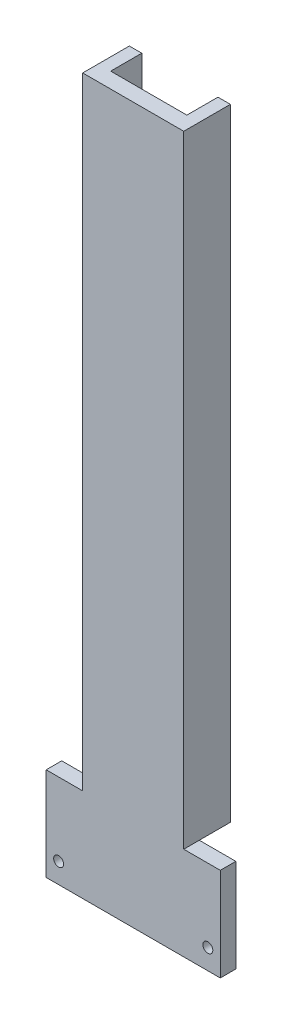
ISO-10303-21;
HEADER;
FILE_DESCRIPTION(('STEP AP214'),'2;1');
FILE_NAME('part.step','',(''),(''),'','','');
FILE_SCHEMA(('AUTOMOTIVE_DESIGN { 1 0 10303 214 1 1 1 1 }'));
ENDSEC;
DATA;
#1=APPLICATION_CONTEXT('core data for automotive mechanical design processes');
#2=APPLICATION_PROTOCOL_DEFINITION('international standard','automotive_design',2000,#1);
#3=PRODUCT_CONTEXT('',#1,'mechanical');
#4=PRODUCT('Part','Part','',(#3));
#5=PRODUCT_RELATED_PRODUCT_CATEGORY('part','',(#4));
#6=PRODUCT_DEFINITION_FORMATION('','',#4);
#7=PRODUCT_DEFINITION_CONTEXT('part definition',#1,'design');
#8=PRODUCT_DEFINITION('design','',#6,#7);
#9=PRODUCT_DEFINITION_SHAPE('','',#8);
#10=(LENGTH_UNIT() NAMED_UNIT(*) SI_UNIT(.MILLI.,.METRE.));
#11=(NAMED_UNIT(*) PLANE_ANGLE_UNIT() SI_UNIT($,.RADIAN.));
#12=(NAMED_UNIT(*) SI_UNIT($,.STERADIAN.) SOLID_ANGLE_UNIT());
#13=UNCERTAINTY_MEASURE_WITH_UNIT(LENGTH_MEASURE(1.E-05),#10,'distance_accuracy_value','');
#14=(GEOMETRIC_REPRESENTATION_CONTEXT(3) GLOBAL_UNCERTAINTY_ASSIGNED_CONTEXT((#13)) GLOBAL_UNIT_ASSIGNED_CONTEXT((#10,
#11,#12)) REPRESENTATION_CONTEXT('',''));
#15=CARTESIAN_POINT('',(0.,0.,0.));
#16=DIRECTION('',(0.,0.,1.));
#17=DIRECTION('',(1.,0.,0.));
#18=AXIS2_PLACEMENT_3D('',#15,#16,#17);
#19=CARTESIAN_POINT('',(0.,0.,0.));
#20=DIRECTION('',(0.,1.,0.));
#21=DIRECTION('',(0.,0.,1.));
#22=AXIS2_PLACEMENT_3D('',#19,#20,#21);
#23=PLANE('',#22);
#24=DIRECTION('',(1.,0.,0.));
#25=VECTOR('',#24,1.);
#26=CARTESIAN_POINT('',(-11.75,0.,10.));
#27=LINE('',#26,#25);
#28=CARTESIAN_POINT('',(0.,0.,10.));
#29=VERTEX_POINT('',#28);
#30=CARTESIAN_POINT('',(4.,0.,10.));
#31=VERTEX_POINT('',#30);
#32=EDGE_CURVE('E11',#29,#31,#27,.T.);
#33=ORIENTED_EDGE('',*,*,#32,.F.);
#34=DIRECTION('',(0.,0.,1.));
#35=VECTOR('',#34,1.);
#36=CARTESIAN_POINT('',(0.,0.,0.));
#37=LINE('',#36,#35);
#38=CARTESIAN_POINT('',(0.,0.,0.));
#39=VERTEX_POINT('',#38);
#40=EDGE_CURVE('E158',#39,#29,#37,.T.);
#41=ORIENTED_EDGE('',*,*,#40,.F.);
#42=DIRECTION('',(-1.,0.,0.));
#43=VECTOR('',#42,1.);
#44=CARTESIAN_POINT('',(4.,0.,0.));
#45=LINE('',#44,#43);
#46=CARTESIAN_POINT('',(4.,0.,0.));
#47=VERTEX_POINT('',#46);
#48=EDGE_CURVE('E152',#47,#39,#45,.T.);
#49=ORIENTED_EDGE('',*,*,#48,.F.);
#50=DIRECTION('',(0.,0.,-1.));
#51=VECTOR('',#50,1.);
#52=CARTESIAN_POINT('',(4.,0.,10.));
#53=LINE('',#52,#51);
#54=EDGE_CURVE('E95',#31,#47,#53,.T.);
#55=ORIENTED_EDGE('',*,*,#54,.F.);
#56=EDGE_LOOP('',(#33,#41,#49,#55));
#57=FACE_BOUND('',#56,.T.);
#58=ADVANCED_FACE('F39',(#57),#23,.F.);
#59=CARTESIAN_POINT('',(28.5,0.,10.));
#60=VERTEX_POINT('',#59);
#61=CARTESIAN_POINT('',(32.5,0.,10.));
#62=VERTEX_POINT('',#61);
#63=EDGE_CURVE('E49',#60,#62,#27,.T.);
#64=ORIENTED_EDGE('',*,*,#63,.F.);
#65=DIRECTION('',(0.,0.,1.));
#66=VECTOR('',#65,1.);
#67=CARTESIAN_POINT('',(28.5,0.,0.));
#68=LINE('',#67,#66);
#69=CARTESIAN_POINT('',(28.5,0.,0.));
#70=VERTEX_POINT('',#69);
#71=EDGE_CURVE('E137',#70,#60,#68,.T.);
#72=ORIENTED_EDGE('',*,*,#71,.F.);
#73=DIRECTION('',(-1.,0.,0.));
#74=VECTOR('',#73,1.);
#75=CARTESIAN_POINT('',(32.5,0.,0.));
#76=LINE('',#75,#74);
#77=CARTESIAN_POINT('',(32.5,0.,0.));
#78=VERTEX_POINT('',#77);
#79=EDGE_CURVE('E166',#78,#70,#76,.T.);
#80=ORIENTED_EDGE('',*,*,#79,.F.);
#81=DIRECTION('',(0.,0.,-1.));
#82=VECTOR('',#81,1.);
#83=CARTESIAN_POINT('',(32.5,0.,15.));
#84=LINE('',#83,#82);
#85=EDGE_CURVE('E161',#62,#78,#84,.T.);
#86=ORIENTED_EDGE('',*,*,#85,.F.);
#87=EDGE_LOOP('',(#64,#72,#80,#86));
#88=FACE_BOUND('',#87,.T.);
#89=ADVANCED_FACE('F279',(#88),#23,.F.);
#90=CARTESIAN_POINT('',(4.,200.,0.));
#91=DIRECTION('',(0.,0.,1.));
#92=DIRECTION('',(1.,0.,0.));
#93=AXIS2_PLACEMENT_3D('',#90,#91,#92);
#94=PLANE('',#93);
#95=ORIENTED_EDGE('',*,*,#48,.T.);
#96=DIRECTION('',(0.,-1.,0.));
#97=VECTOR('',#96,1.);
#98=CARTESIAN_POINT('',(0.,200.,0.));
#99=LINE('',#98,#97);
#100=CARTESIAN_POINT('',(0.,200.,0.));
#101=VERTEX_POINT('',#100);
#102=EDGE_CURVE('E43',#101,#39,#99,.T.);
#103=ORIENTED_EDGE('',*,*,#102,.F.);
#104=DIRECTION('',(-1.,0.,0.));
#105=VECTOR('',#104,1.);
#106=CARTESIAN_POINT('',(4.,200.,0.));
#107=LINE('',#106,#105);
#108=CARTESIAN_POINT('',(4.,200.,0.));
#109=VERTEX_POINT('',#108);
#110=EDGE_CURVE('E173',#109,#101,#107,.T.);
#111=ORIENTED_EDGE('',*,*,#110,.F.);
#112=DIRECTION('',(0.,-1.,0.));
#113=VECTOR('',#112,1.);
#114=CARTESIAN_POINT('',(4.,200.,0.));
#115=LINE('',#114,#113);
#116=EDGE_CURVE('E148',#109,#47,#115,.T.);
#117=ORIENTED_EDGE('',*,*,#116,.T.);
#118=EDGE_LOOP('',(#95,#103,#111,#117));
#119=FACE_BOUND('',#118,.T.);
#120=ADVANCED_FACE('F41',(#119),#94,.F.);
#121=CARTESIAN_POINT('',(0.,200.,0.));
#122=DIRECTION('',(1.,0.,0.));
#123=DIRECTION('',(0.,0.,-1.));
#124=AXIS2_PLACEMENT_3D('',#121,#122,#123);
#125=PLANE('',#124);
#126=ORIENTED_EDGE('',*,*,#40,.T.);
#127=CARTESIAN_POINT('',(0.,0.,15.));
#128=VERTEX_POINT('',#127);
#129=EDGE_CURVE('E156',#29,#128,#37,.T.);
#130=ORIENTED_EDGE('',*,*,#129,.T.);
#131=DIRECTION('',(0.,-1.,0.));
#132=VECTOR('',#131,1.);
#133=CARTESIAN_POINT('',(0.,200.,15.));
#134=LINE('',#133,#132);
#135=CARTESIAN_POINT('',(0.,200.,15.));
#136=VERTEX_POINT('',#135);
#137=EDGE_CURVE('E186',#136,#128,#134,.T.);
#138=ORIENTED_EDGE('',*,*,#137,.F.);
#139=DIRECTION('',(0.,0.,1.));
#140=VECTOR('',#139,1.);
#141=CARTESIAN_POINT('',(0.,200.,0.));
#142=LINE('',#141,#140);
#143=EDGE_CURVE('E104',#101,#136,#142,.T.);
#144=ORIENTED_EDGE('',*,*,#143,.F.);
#145=ORIENTED_EDGE('',*,*,#102,.T.);
#146=EDGE_LOOP('',(#126,#130,#138,#144,#145));
#147=FACE_BOUND('',#146,.T.);
#148=ADVANCED_FACE('F303',(#147),#125,.F.);
#149=CARTESIAN_POINT('',(0.,200.,15.));
#150=DIRECTION('',(0.,0.,-1.));
#151=DIRECTION('',(-1.,0.,0.));
#152=AXIS2_PLACEMENT_3D('',#149,#150,#151);
#153=PLANE('',#152);
#154=CARTESIAN_POINT('',(-7.75,-23.5,15.));
#155=DIRECTION('',(0.,0.,-1.));
#156=DIRECTION('',(-1.,0.,0.));
#157=AXIS2_PLACEMENT_3D('',#154,#155,#156);
#158=CIRCLE('',#157,1.6);
#159=CARTESIAN_POINT('',(-9.35,-23.5,15.));
#160=VERTEX_POINT('',#159);
#161=EDGE_CURVE('E241',#160,#160,#158,.T.);
#162=ORIENTED_EDGE('',*,*,#161,.T.);
#163=EDGE_LOOP('',(#162));
#164=FACE_BOUND('',#163,.T.);
#165=CARTESIAN_POINT('',(40.25,-23.5,15.));
#166=DIRECTION('',(0.,0.,-1.));
#167=DIRECTION('',(-1.,0.,0.));
#168=AXIS2_PLACEMENT_3D('',#165,#166,#167);
#169=CIRCLE('',#168,1.6);
#170=CARTESIAN_POINT('',(38.65,-23.5,15.));
#171=VERTEX_POINT('',#170);
#172=EDGE_CURVE('E228',#171,#171,#169,.T.);
#173=ORIENTED_EDGE('',*,*,#172,.T.);
#174=EDGE_LOOP('',(#173));
#175=FACE_BOUND('',#174,.T.);
#176=ORIENTED_EDGE('',*,*,#137,.T.);
#177=DIRECTION('',(1.,0.,0.));
#178=VECTOR('',#177,1.);
#179=CARTESIAN_POINT('',(32.5,0.,15.));
#180=LINE('',#179,#178);
#181=CARTESIAN_POINT('',(-11.75,0.,15.));
#182=VERTEX_POINT('',#181);
#183=EDGE_CURVE('E227',#182,#128,#180,.T.);
#184=ORIENTED_EDGE('',*,*,#183,.F.);
#185=DIRECTION('',(0.,1.,0.));
#186=VECTOR('',#185,1.);
#187=CARTESIAN_POINT('',(-11.75,-30.,15.));
#188=LINE('',#187,#186);
#189=CARTESIAN_POINT('',(-11.75,-30.,15.));
#190=VERTEX_POINT('',#189);
#191=EDGE_CURVE('E373',#190,#182,#188,.T.);
#192=ORIENTED_EDGE('',*,*,#191,.F.);
#193=DIRECTION('',(-1.,0.,0.));
#194=VECTOR('',#193,1.);
#195=CARTESIAN_POINT('',(44.25,-30.,15.));
#196=LINE('',#195,#194);
#197=CARTESIAN_POINT('',(44.25,-30.,15.));
#198=VERTEX_POINT('',#197);
#199=EDGE_CURVE('E378',#198,#190,#196,.T.);
#200=ORIENTED_EDGE('',*,*,#199,.F.);
#201=DIRECTION('',(0.,-1.,0.));
#202=VECTOR('',#201,1.);
#203=CARTESIAN_POINT('',(44.25,0.,15.));
#204=LINE('',#203,#202);
#205=CARTESIAN_POINT('',(44.25,0.,15.));
#206=VERTEX_POINT('',#205);
#207=EDGE_CURVE('E232',#206,#198,#204,.T.);
#208=ORIENTED_EDGE('',*,*,#207,.F.);
#209=CARTESIAN_POINT('',(32.5,0.,15.));
#210=VERTEX_POINT('',#209);
#211=EDGE_CURVE('E349',#210,#206,#180,.T.);
#212=ORIENTED_EDGE('',*,*,#211,.F.);
#213=DIRECTION('',(0.,-1.,0.));
#214=VECTOR('',#213,1.);
#215=CARTESIAN_POINT('',(32.5,200.,15.));
#216=LINE('',#215,#214);
#217=CARTESIAN_POINT('',(32.5,200.,15.));
#218=VERTEX_POINT('',#217);
#219=EDGE_CURVE('E184',#218,#210,#216,.T.);
#220=ORIENTED_EDGE('',*,*,#219,.F.);
#221=DIRECTION('',(1.,0.,0.));
#222=VECTOR('',#221,1.);
#223=CARTESIAN_POINT('',(0.,200.,15.));
#224=LINE('',#223,#222);
#225=EDGE_CURVE('E332',#136,#218,#224,.T.);
#226=ORIENTED_EDGE('',*,*,#225,.F.);
#227=EDGE_LOOP('',(#176,#184,#192,#200,#208,#212,#220,#226));
#228=FACE_BOUND('',#227,.T.);
#229=ADVANCED_FACE('F300',(#164,#175,#228),#153,.F.);
#230=CARTESIAN_POINT('',(32.5,200.,15.));
#231=DIRECTION('',(-1.,0.,0.));
#232=DIRECTION('',(0.,0.,1.));
#233=AXIS2_PLACEMENT_3D('',#230,#231,#232);
#234=PLANE('',#233);
#235=EDGE_CURVE('E162',#210,#62,#84,.T.);
#236=ORIENTED_EDGE('',*,*,#235,.T.);
#237=ORIENTED_EDGE('',*,*,#85,.T.);
#238=DIRECTION('',(0.,-1.,0.));
#239=VECTOR('',#238,1.);
#240=CARTESIAN_POINT('',(32.5,200.,0.));
#241=LINE('',#240,#239);
#242=CARTESIAN_POINT('',(32.5,200.,0.));
#243=VERTEX_POINT('',#242);
#244=EDGE_CURVE('E180',#243,#78,#241,.T.);
#245=ORIENTED_EDGE('',*,*,#244,.F.);
#246=DIRECTION('',(0.,0.,-1.));
#247=VECTOR('',#246,1.);
#248=CARTESIAN_POINT('',(32.5,200.,15.));
#249=LINE('',#248,#247);
#250=EDGE_CURVE('E335',#218,#243,#249,.T.);
#251=ORIENTED_EDGE('',*,*,#250,.F.);
#252=ORIENTED_EDGE('',*,*,#219,.T.);
#253=EDGE_LOOP('',(#236,#237,#245,#251,#252));
#254=FACE_BOUND('',#253,.T.);
#255=ADVANCED_FACE('F296',(#254),#234,.F.);
#256=CARTESIAN_POINT('',(32.5,200.,0.));
#257=DIRECTION('',(0.,0.,1.));
#258=DIRECTION('',(1.,0.,0.));
#259=AXIS2_PLACEMENT_3D('',#256,#257,#258);
#260=PLANE('',#259);
#261=ORIENTED_EDGE('',*,*,#79,.T.);
#262=DIRECTION('',(0.,-1.,0.));
#263=VECTOR('',#262,1.);
#264=CARTESIAN_POINT('',(28.5,200.,0.));
#265=LINE('',#264,#263);
#266=CARTESIAN_POINT('',(28.5,200.,0.));
#267=VERTEX_POINT('',#266);
#268=EDGE_CURVE('E141',#267,#70,#265,.T.);
#269=ORIENTED_EDGE('',*,*,#268,.F.);
#270=DIRECTION('',(-1.,0.,0.));
#271=VECTOR('',#270,1.);
#272=CARTESIAN_POINT('',(32.5,200.,0.));
#273=LINE('',#272,#271);
#274=EDGE_CURVE('E126',#243,#267,#273,.T.);
#275=ORIENTED_EDGE('',*,*,#274,.F.);
#276=ORIENTED_EDGE('',*,*,#244,.T.);
#277=EDGE_LOOP('',(#261,#269,#275,#276));
#278=FACE_BOUND('',#277,.T.);
#279=ADVANCED_FACE('F293',(#278),#260,.F.);
#280=CARTESIAN_POINT('',(28.5,200.,0.));
#281=DIRECTION('',(1.,0.,0.));
#282=DIRECTION('',(0.,0.,-1.));
#283=AXIS2_PLACEMENT_3D('',#280,#281,#282);
#284=PLANE('',#283);
#285=ORIENTED_EDGE('',*,*,#71,.T.);
#286=DIRECTION('',(0.,-1.,0.));
#287=VECTOR('',#286,1.);
#288=CARTESIAN_POINT('',(28.5,200.,10.));
#289=LINE('',#288,#287);
#290=CARTESIAN_POINT('',(28.5,200.,10.));
#291=VERTEX_POINT('',#290);
#292=EDGE_CURVE('E134',#291,#60,#289,.T.);
#293=ORIENTED_EDGE('',*,*,#292,.F.);
#294=DIRECTION('',(0.,0.,1.));
#295=VECTOR('',#294,1.);
#296=CARTESIAN_POINT('',(28.5,200.,0.));
#297=LINE('',#296,#295);
#298=EDGE_CURVE('E119',#267,#291,#297,.T.);
#299=ORIENTED_EDGE('',*,*,#298,.F.);
#300=ORIENTED_EDGE('',*,*,#268,.T.);
#301=EDGE_LOOP('',(#285,#293,#299,#300));
#302=FACE_BOUND('',#301,.T.);
#303=ADVANCED_FACE('F135',(#302),#284,.F.);
#304=CARTESIAN_POINT('',(28.5,200.,10.));
#305=DIRECTION('',(0.,0.,1.));
#306=DIRECTION('',(1.,0.,0.));
#307=AXIS2_PLACEMENT_3D('',#304,#305,#306);
#308=PLANE('',#307);
#309=CARTESIAN_POINT('',(-7.75,-23.5,10.));
#310=DIRECTION('',(0.,0.,-1.));
#311=DIRECTION('',(-1.,0.,0.));
#312=AXIS2_PLACEMENT_3D('',#309,#310,#311);
#313=CIRCLE('',#312,1.625);
#314=CARTESIAN_POINT('',(-9.37500000000001,-23.5,10.));
#315=VERTEX_POINT('',#314);
#316=EDGE_CURVE('E249',#315,#315,#313,.T.);
#317=ORIENTED_EDGE('',*,*,#316,.F.);
#318=EDGE_LOOP('',(#317));
#319=FACE_BOUND('',#318,.T.);
#320=CARTESIAN_POINT('',(40.25,-23.5,10.));
#321=DIRECTION('',(0.,0.,-1.));
#322=DIRECTION('',(-1.,0.,0.));
#323=AXIS2_PLACEMENT_3D('',#320,#321,#322);
#324=CIRCLE('',#323,1.625);
#325=CARTESIAN_POINT('',(38.625,-23.5,10.));
#326=VERTEX_POINT('',#325);
#327=EDGE_CURVE('E237',#326,#326,#324,.T.);
#328=ORIENTED_EDGE('',*,*,#327,.F.);
#329=EDGE_LOOP('',(#328));
#330=FACE_BOUND('',#329,.T.);
#331=ORIENTED_EDGE('',*,*,#292,.T.);
#332=ORIENTED_EDGE('',*,*,#63,.T.);
#333=CARTESIAN_POINT('',(44.25,0.,10.));
#334=VERTEX_POINT('',#333);
#335=EDGE_CURVE('E51',#62,#334,#27,.T.);
#336=ORIENTED_EDGE('',*,*,#335,.T.);
#337=DIRECTION('',(0.,-1.,0.));
#338=VECTOR('',#337,1.);
#339=CARTESIAN_POINT('',(44.25,0.,10.));
#340=LINE('',#339,#338);
#341=CARTESIAN_POINT('',(44.25,-30.,10.));
#342=VERTEX_POINT('',#341);
#343=EDGE_CURVE('E222',#334,#342,#340,.T.);
#344=ORIENTED_EDGE('',*,*,#343,.T.);
#345=DIRECTION('',(-1.,0.,0.));
#346=VECTOR('',#345,1.);
#347=CARTESIAN_POINT('',(44.25,-30.,10.));
#348=LINE('',#347,#346);
#349=CARTESIAN_POINT('',(-11.75,-30.,10.));
#350=VERTEX_POINT('',#349);
#351=EDGE_CURVE('E216',#342,#350,#348,.T.);
#352=ORIENTED_EDGE('',*,*,#351,.T.);
#353=DIRECTION('',(0.,1.,0.));
#354=VECTOR('',#353,1.);
#355=CARTESIAN_POINT('',(-11.75,-30.,10.));
#356=LINE('',#355,#354);
#357=CARTESIAN_POINT('',(-11.75,0.,10.));
#358=VERTEX_POINT('',#357);
#359=EDGE_CURVE('E210',#350,#358,#356,.T.);
#360=ORIENTED_EDGE('',*,*,#359,.T.);
#361=EDGE_CURVE('E196',#358,#29,#27,.T.);
#362=ORIENTED_EDGE('',*,*,#361,.T.);
#363=ORIENTED_EDGE('',*,*,#32,.T.);
#364=DIRECTION('',(0.,-1.,0.));
#365=VECTOR('',#364,1.);
#366=CARTESIAN_POINT('',(4.,200.,10.));
#367=LINE('',#366,#365);
#368=CARTESIAN_POINT('',(4.,200.,10.));
#369=VERTEX_POINT('',#368);
#370=EDGE_CURVE('E142',#369,#31,#367,.T.);
#371=ORIENTED_EDGE('',*,*,#370,.F.);
#372=DIRECTION('',(-1.,0.,0.));
#373=VECTOR('',#372,1.);
#374=CARTESIAN_POINT('',(28.5,200.,10.));
#375=LINE('',#374,#373);
#376=EDGE_CURVE('E123',#291,#369,#375,.T.);
#377=ORIENTED_EDGE('',*,*,#376,.F.);
#378=EDGE_LOOP('',(#331,#332,#336,#344,#352,#360,#362,#363,#371,#377));
#379=FACE_BOUND('',#378,.T.);
#380=ADVANCED_FACE('F144',(#319,#330,#379),#308,.F.);
#381=CARTESIAN_POINT('',(4.,200.,10.));
#382=DIRECTION('',(-1.,0.,0.));
#383=DIRECTION('',(0.,0.,1.));
#384=AXIS2_PLACEMENT_3D('',#381,#382,#383);
#385=PLANE('',#384);
#386=ORIENTED_EDGE('',*,*,#54,.T.);
#387=ORIENTED_EDGE('',*,*,#116,.F.);
#388=DIRECTION('',(0.,0.,-1.));
#389=VECTOR('',#388,1.);
#390=CARTESIAN_POINT('',(4.,200.,10.));
#391=LINE('',#390,#389);
#392=EDGE_CURVE('E65',#369,#109,#391,.T.);
#393=ORIENTED_EDGE('',*,*,#392,.F.);
#394=ORIENTED_EDGE('',*,*,#370,.T.);
#395=EDGE_LOOP('',(#386,#387,#393,#394));
#396=FACE_BOUND('',#395,.T.);
#397=ADVANCED_FACE('F258',(#396),#385,.F.);
#398=CARTESIAN_POINT('',(0.,200.,0.));
#399=DIRECTION('',(0.,1.,0.));
#400=DIRECTION('',(0.,0.,1.));
#401=AXIS2_PLACEMENT_3D('',#398,#399,#400);
#402=PLANE('',#401);
#403=ORIENTED_EDGE('',*,*,#110,.T.);
#404=ORIENTED_EDGE('',*,*,#143,.T.);
#405=ORIENTED_EDGE('',*,*,#225,.T.);
#406=ORIENTED_EDGE('',*,*,#250,.T.);
#407=ORIENTED_EDGE('',*,*,#274,.T.);
#408=ORIENTED_EDGE('',*,*,#298,.T.);
#409=ORIENTED_EDGE('',*,*,#376,.T.);
#410=ORIENTED_EDGE('',*,*,#392,.T.);
#411=EDGE_LOOP('',(#403,#404,#405,#406,#407,#408,#409,#410));
#412=FACE_BOUND('',#411,.T.);
#413=ADVANCED_FACE('F121',(#412),#402,.T.);
#414=CARTESIAN_POINT('',(32.5,0.,10.));
#415=DIRECTION('',(0.,-1.,0.));
#416=DIRECTION('',(0.,0.,-1.));
#417=AXIS2_PLACEMENT_3D('',#414,#415,#416);
#418=PLANE('',#417);
#419=ORIENTED_EDGE('',*,*,#235,.F.);
#420=ORIENTED_EDGE('',*,*,#211,.T.);
#421=DIRECTION('',(0.,0.,1.));
#422=VECTOR('',#421,1.);
#423=CARTESIAN_POINT('',(44.25,0.,10.));
#424=LINE('',#423,#422);
#425=EDGE_CURVE('E202',#334,#206,#424,.T.);
#426=ORIENTED_EDGE('',*,*,#425,.F.);
#427=ORIENTED_EDGE('',*,*,#335,.F.);
#428=EDGE_LOOP('',(#419,#420,#426,#427));
#429=FACE_BOUND('',#428,.T.);
#430=ADVANCED_FACE('F344',(#429),#418,.F.);
#431=CARTESIAN_POINT('',(44.25,0.,10.));
#432=DIRECTION('',(-1.,0.,0.));
#433=DIRECTION('',(0.,-1.,0.));
#434=AXIS2_PLACEMENT_3D('',#431,#432,#433);
#435=PLANE('',#434);
#436=ORIENTED_EDGE('',*,*,#207,.T.);
#437=DIRECTION('',(0.,0.,1.));
#438=VECTOR('',#437,1.);
#439=CARTESIAN_POINT('',(44.25,-30.,10.));
#440=LINE('',#439,#438);
#441=EDGE_CURVE('E157',#342,#198,#440,.T.);
#442=ORIENTED_EDGE('',*,*,#441,.F.);
#443=ORIENTED_EDGE('',*,*,#343,.F.);
#444=ORIENTED_EDGE('',*,*,#425,.T.);
#445=EDGE_LOOP('',(#436,#442,#443,#444));
#446=FACE_BOUND('',#445,.T.);
#447=ADVANCED_FACE('F355',(#446),#435,.F.);
#448=CARTESIAN_POINT('',(44.25,-30.,10.));
#449=DIRECTION('',(0.,1.,0.));
#450=DIRECTION('',(-1.,0.,0.));
#451=AXIS2_PLACEMENT_3D('',#448,#449,#450);
#452=PLANE('',#451);
#453=ORIENTED_EDGE('',*,*,#199,.T.);
#454=DIRECTION('',(0.,0.,1.));
#455=VECTOR('',#454,1.);
#456=CARTESIAN_POINT('',(-11.75,-30.,10.));
#457=LINE('',#456,#455);
#458=EDGE_CURVE('E319',#350,#190,#457,.T.);
#459=ORIENTED_EDGE('',*,*,#458,.F.);
#460=ORIENTED_EDGE('',*,*,#351,.F.);
#461=ORIENTED_EDGE('',*,*,#441,.T.);
#462=EDGE_LOOP('',(#453,#459,#460,#461));
#463=FACE_BOUND('',#462,.T.);
#464=ADVANCED_FACE('F385',(#463),#452,.F.);
#465=CARTESIAN_POINT('',(-11.75,-30.,10.));
#466=DIRECTION('',(1.,0.,0.));
#467=DIRECTION('',(0.,1.,0.));
#468=AXIS2_PLACEMENT_3D('',#465,#466,#467);
#469=PLANE('',#468);
#470=ORIENTED_EDGE('',*,*,#191,.T.);
#471=DIRECTION('',(0.,0.,1.));
#472=VECTOR('',#471,1.);
#473=CARTESIAN_POINT('',(-11.75,0.,10.));
#474=LINE('',#473,#472);
#475=EDGE_CURVE('E208',#358,#182,#474,.T.);
#476=ORIENTED_EDGE('',*,*,#475,.F.);
#477=ORIENTED_EDGE('',*,*,#359,.F.);
#478=ORIENTED_EDGE('',*,*,#458,.T.);
#479=EDGE_LOOP('',(#470,#476,#477,#478));
#480=FACE_BOUND('',#479,.T.);
#481=ADVANCED_FACE('F376',(#480),#469,.F.);
#482=ORIENTED_EDGE('',*,*,#129,.F.);
#483=ORIENTED_EDGE('',*,*,#361,.F.);
#484=ORIENTED_EDGE('',*,*,#475,.T.);
#485=ORIENTED_EDGE('',*,*,#183,.T.);
#486=EDGE_LOOP('',(#482,#483,#484,#485));
#487=FACE_BOUND('',#486,.T.);
#488=ADVANCED_FACE('F274',(#487),#418,.F.);
#489=CARTESIAN_POINT('',(40.25,-23.5,10.));
#490=DIRECTION('',(0.,0.,-1.));
#491=DIRECTION('',(-1.,0.,0.));
#492=AXIS2_PLACEMENT_3D('',#489,#490,#491);
#493=CYLINDRICAL_SURFACE('',#492,1.6);
#494=ORIENTED_EDGE('',*,*,#172,.F.);
#495=EDGE_LOOP('',(#494));
#496=FACE_BOUND('',#495,.T.);
#497=CARTESIAN_POINT('',(40.25,-23.5,10.025));
#498=DIRECTION('',(0.,0.,-1.));
#499=DIRECTION('',(-1.,0.,0.));
#500=AXIS2_PLACEMENT_3D('',#497,#498,#499);
#501=CIRCLE('',#500,1.6);
#502=CARTESIAN_POINT('',(38.65,-23.5,10.025));
#503=VERTEX_POINT('',#502);
#504=EDGE_CURVE('E233',#503,#503,#501,.T.);
#505=ORIENTED_EDGE('',*,*,#504,.T.);
#506=EDGE_LOOP('',(#505));
#507=FACE_BOUND('',#506,.T.);
#508=ADVANCED_FACE('F265',(#496,#507),#493,.F.);
#509=CARTESIAN_POINT('',(40.25,-23.5,10.));
#510=DIRECTION('',(0.,0.,-1.));
#511=DIRECTION('',(-1.,0.,0.));
#512=AXIS2_PLACEMENT_3D('',#509,#510,#511);
#513=CONICAL_SURFACE('',#512,1.625,0.785398163397483);
#514=ORIENTED_EDGE('',*,*,#504,.F.);
#515=EDGE_LOOP('',(#514));
#516=FACE_BOUND('',#515,.T.);
#517=ORIENTED_EDGE('',*,*,#327,.T.);
#518=EDGE_LOOP('',(#517));
#519=FACE_BOUND('',#518,.T.);
#520=ADVANCED_FACE('F262',(#516,#519),#513,.F.);
#521=CARTESIAN_POINT('',(-7.75,-23.5,10.));
#522=DIRECTION('',(0.,0.,-1.));
#523=DIRECTION('',(-1.,0.,0.));
#524=AXIS2_PLACEMENT_3D('',#521,#522,#523);
#525=CYLINDRICAL_SURFACE('',#524,1.6);
#526=ORIENTED_EDGE('',*,*,#161,.F.);
#527=EDGE_LOOP('',(#526));
#528=FACE_BOUND('',#527,.T.);
#529=CARTESIAN_POINT('',(-7.75,-23.5,10.025));
#530=DIRECTION('',(0.,0.,-1.));
#531=DIRECTION('',(-1.,0.,0.));
#532=AXIS2_PLACEMENT_3D('',#529,#530,#531);
#533=CIRCLE('',#532,1.6);
#534=CARTESIAN_POINT('',(-9.35,-23.5,10.025));
#535=VERTEX_POINT('',#534);
#536=EDGE_CURVE('E245',#535,#535,#533,.T.);
#537=ORIENTED_EDGE('',*,*,#536,.T.);
#538=EDGE_LOOP('',(#537));
#539=FACE_BOUND('',#538,.T.);
#540=ADVANCED_FACE('F264',(#528,#539),#525,.F.);
#541=CARTESIAN_POINT('',(-7.75,-23.5,10.));
#542=DIRECTION('',(0.,0.,-1.));
#543=DIRECTION('',(-1.,0.,0.));
#544=AXIS2_PLACEMENT_3D('',#541,#542,#543);
#545=CONICAL_SURFACE('',#544,1.625,0.785398163397414);
#546=ORIENTED_EDGE('',*,*,#536,.F.);
#547=EDGE_LOOP('',(#546));
#548=FACE_BOUND('',#547,.T.);
#549=ORIENTED_EDGE('',*,*,#316,.T.);
#550=EDGE_LOOP('',(#549));
#551=FACE_BOUND('',#550,.T.);
#552=ADVANCED_FACE('F254',(#548,#551),#545,.F.);
#553=CLOSED_SHELL('',(#58,#89,#120,#148,#229,#255,#279,#303,#380,#397,#413,#430,#447,#464,#481,
#488,#508,#520,#540,#552));
#554=MANIFOLD_SOLID_BREP('B2',#553);
#555=ADVANCED_BREP_SHAPE_REPRESENTATION('',(#18,#554),#14);
#556=SHAPE_DEFINITION_REPRESENTATION(#9,#555);
ENDSEC;
END-ISO-10303-21;
